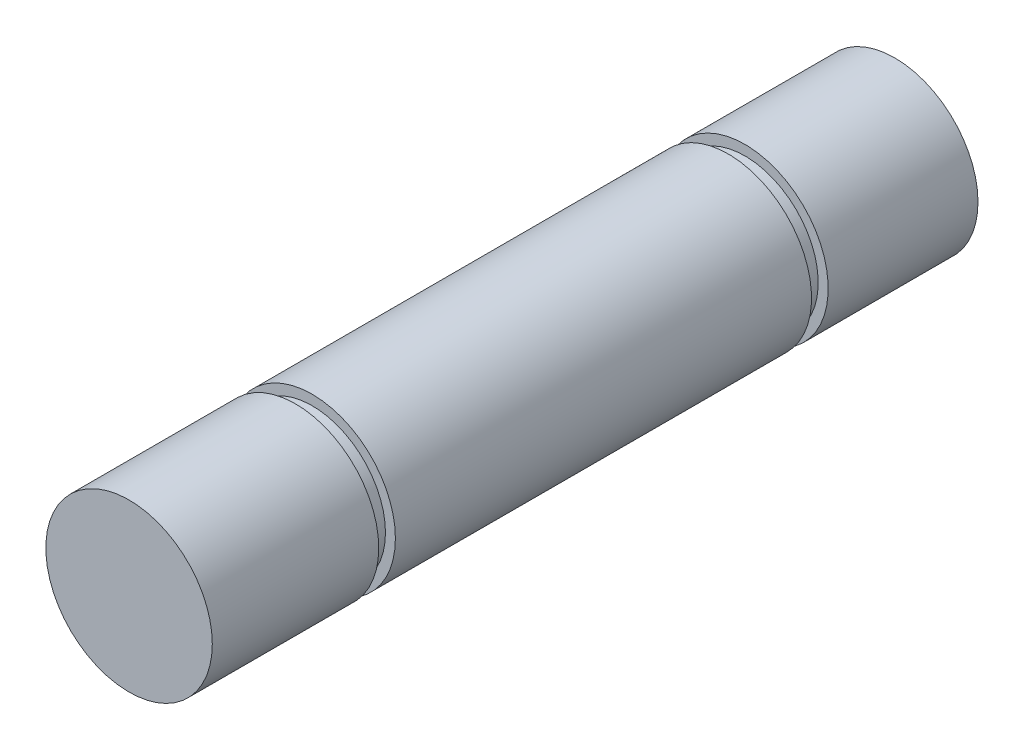
ISO-10303-21;
HEADER;
FILE_DESCRIPTION(('STEP AP214'),'2;1');
FILE_NAME('part.step','',(''),(''),'','','');
FILE_SCHEMA(('AUTOMOTIVE_DESIGN { 1 0 10303 214 1 1 1 1 }'));
ENDSEC;
DATA;
#1=APPLICATION_CONTEXT('core data for automotive mechanical design processes');
#2=APPLICATION_PROTOCOL_DEFINITION('international standard','automotive_design',2000,#1);
#3=PRODUCT_CONTEXT('',#1,'mechanical');
#4=PRODUCT('Part','Part','',(#3));
#5=PRODUCT_RELATED_PRODUCT_CATEGORY('part','',(#4));
#6=PRODUCT_DEFINITION_FORMATION('','',#4);
#7=PRODUCT_DEFINITION_CONTEXT('part definition',#1,'design');
#8=PRODUCT_DEFINITION('design','',#6,#7);
#9=PRODUCT_DEFINITION_SHAPE('','',#8);
#10=(LENGTH_UNIT() NAMED_UNIT(*) SI_UNIT(.MILLI.,.METRE.));
#11=(NAMED_UNIT(*) PLANE_ANGLE_UNIT() SI_UNIT($,.RADIAN.));
#12=(NAMED_UNIT(*) SI_UNIT($,.STERADIAN.) SOLID_ANGLE_UNIT());
#13=UNCERTAINTY_MEASURE_WITH_UNIT(LENGTH_MEASURE(1.E-05),#10,'distance_accuracy_value','');
#14=(GEOMETRIC_REPRESENTATION_CONTEXT(3) GLOBAL_UNCERTAINTY_ASSIGNED_CONTEXT((#13)) GLOBAL_UNIT_ASSIGNED_CONTEXT((#10,
#11,#12)) REPRESENTATION_CONTEXT('',''));
#15=CARTESIAN_POINT('',(0.,0.,0.));
#16=DIRECTION('',(0.,0.,1.));
#17=DIRECTION('',(1.,0.,0.));
#18=AXIS2_PLACEMENT_3D('',#15,#16,#17);
#19=CARTESIAN_POINT('',(0.,0.,23.));
#20=DIRECTION('',(0.,0.,-1.));
#21=DIRECTION('',(-1.,0.,0.));
#22=AXIS2_PLACEMENT_3D('',#19,#20,#21);
#23=CYLINDRICAL_SURFACE('',#22,2.5);
#24=CARTESIAN_POINT('',(0.,0.,17.5));
#25=DIRECTION('',(0.,0.,1.));
#26=DIRECTION('',(1.,0.,0.));
#27=AXIS2_PLACEMENT_3D('',#24,#25,#26);
#28=CIRCLE('',#27,2.5);
#29=CARTESIAN_POINT('',(2.5,0.,17.5));
#30=VERTEX_POINT('',#29);
#31=EDGE_CURVE('E42',#30,#30,#28,.T.);
#32=ORIENTED_EDGE('',*,*,#31,.F.);
#33=EDGE_LOOP('',(#32));
#34=FACE_BOUND('',#33,.T.);
#35=CARTESIAN_POINT('',(0.,0.,5.));
#36=DIRECTION('',(0.,0.,-1.));
#37=DIRECTION('',(-1.,0.,0.));
#38=AXIS2_PLACEMENT_3D('',#35,#36,#37);
#39=CIRCLE('',#38,2.5);
#40=CARTESIAN_POINT('',(-2.5,0.,5.));
#41=VERTEX_POINT('',#40);
#42=EDGE_CURVE('E56',#41,#41,#39,.T.);
#43=ORIENTED_EDGE('',*,*,#42,.F.);
#44=EDGE_LOOP('',(#43));
#45=FACE_BOUND('',#44,.T.);
#46=ADVANCED_FACE('F31',(#34,#45),#23,.T.);
#47=CARTESIAN_POINT('',(0.,0.,17.5));
#48=DIRECTION('',(0.,0.,1.));
#49=DIRECTION('',(1.,0.,0.));
#50=AXIS2_PLACEMENT_3D('',#47,#48,#49);
#51=PLANE('',#50);
#52=CARTESIAN_POINT('',(0.,0.,17.5));
#53=DIRECTION('',(0.,0.,1.));
#54=DIRECTION('',(1.,0.,0.));
#55=AXIS2_PLACEMENT_3D('',#52,#53,#54);
#56=CIRCLE('',#55,2.20136738625725);
#57=CARTESIAN_POINT('',(2.20136738625725,0.,17.5));
#58=VERTEX_POINT('',#57);
#59=EDGE_CURVE('E47',#58,#58,#56,.T.);
#60=ORIENTED_EDGE('',*,*,#59,.F.);
#61=EDGE_LOOP('',(#60));
#62=FACE_BOUND('',#61,.T.);
#63=ORIENTED_EDGE('',*,*,#31,.T.);
#64=EDGE_LOOP('',(#63));
#65=FACE_BOUND('',#64,.T.);
#66=ADVANCED_FACE('F88',(#62,#65),#51,.T.);
#67=CARTESIAN_POINT('',(0.,0.,18.));
#68=DIRECTION('',(0.,0.,1.));
#69=DIRECTION('',(1.,0.,0.));
#70=AXIS2_PLACEMENT_3D('',#67,#68,#69);
#71=PLANE('',#70);
#72=CARTESIAN_POINT('',(0.,0.,18.));
#73=DIRECTION('',(0.,0.,1.));
#74=DIRECTION('',(1.,0.,0.));
#75=AXIS2_PLACEMENT_3D('',#72,#73,#74);
#76=CIRCLE('',#75,2.20136738625725);
#77=CARTESIAN_POINT('',(2.20136738625725,0.,18.));
#78=VERTEX_POINT('',#77);
#79=EDGE_CURVE('E50',#78,#78,#76,.T.);
#80=ORIENTED_EDGE('',*,*,#79,.T.);
#81=EDGE_LOOP('',(#80));
#82=FACE_BOUND('',#81,.T.);
#83=CARTESIAN_POINT('',(0.,0.,18.));
#84=DIRECTION('',(0.,0.,1.));
#85=DIRECTION('',(1.,0.,0.));
#86=AXIS2_PLACEMENT_3D('',#83,#84,#85);
#87=CIRCLE('',#86,2.5);
#88=CARTESIAN_POINT('',(2.5,0.,18.));
#89=VERTEX_POINT('',#88);
#90=EDGE_CURVE('E44',#89,#89,#87,.T.);
#91=ORIENTED_EDGE('',*,*,#90,.F.);
#92=EDGE_LOOP('',(#91));
#93=FACE_BOUND('',#92,.T.);
#94=ADVANCED_FACE('F96',(#82,#93),#71,.F.);
#95=CARTESIAN_POINT('',(0.,0.,17.5));
#96=DIRECTION('',(0.,0.,1.));
#97=DIRECTION('',(1.,0.,0.));
#98=AXIS2_PLACEMENT_3D('',#95,#96,#97);
#99=CYLINDRICAL_SURFACE('',#98,2.20136738625725);
#100=ORIENTED_EDGE('',*,*,#59,.T.);
#101=EDGE_LOOP('',(#100));
#102=FACE_BOUND('',#101,.T.);
#103=ORIENTED_EDGE('',*,*,#79,.F.);
#104=EDGE_LOOP('',(#103));
#105=FACE_BOUND('',#104,.T.);
#106=ADVANCED_FACE('F109',(#102,#105),#99,.T.);
#107=CARTESIAN_POINT('',(0.,0.,23.));
#108=DIRECTION('',(0.,0.,1.));
#109=DIRECTION('',(1.,0.,0.));
#110=AXIS2_PLACEMENT_3D('',#107,#108,#109);
#111=PLANE('',#110);
#112=CARTESIAN_POINT('',(0.,0.,23.));
#113=DIRECTION('',(0.,0.,1.));
#114=DIRECTION('',(1.,0.,0.));
#115=AXIS2_PLACEMENT_3D('',#112,#113,#114);
#116=CIRCLE('',#115,2.5);
#117=CARTESIAN_POINT('',(2.5,0.,23.));
#118=VERTEX_POINT('',#117);
#119=EDGE_CURVE('E10',#118,#118,#116,.T.);
#120=ORIENTED_EDGE('',*,*,#119,.T.);
#121=EDGE_LOOP('',(#120));
#122=FACE_BOUND('',#121,.T.);
#123=ADVANCED_FACE('F103',(#122),#111,.T.);
#124=ORIENTED_EDGE('',*,*,#90,.T.);
#125=EDGE_LOOP('',(#124));
#126=FACE_BOUND('',#125,.T.);
#127=ORIENTED_EDGE('',*,*,#119,.F.);
#128=EDGE_LOOP('',(#127));
#129=FACE_BOUND('',#128,.T.);
#130=ADVANCED_FACE('F33',(#126,#129),#23,.T.);
#131=CARTESIAN_POINT('',(0.,0.,4.5));
#132=DIRECTION('',(0.,0.,-1.));
#133=DIRECTION('',(-1.,0.,0.));
#134=AXIS2_PLACEMENT_3D('',#131,#132,#133);
#135=PLANE('',#134);
#136=CARTESIAN_POINT('',(0.,0.,4.5));
#137=DIRECTION('',(0.,0.,-1.));
#138=DIRECTION('',(-1.,0.,0.));
#139=AXIS2_PLACEMENT_3D('',#136,#137,#138);
#140=CIRCLE('',#139,2.5);
#141=CARTESIAN_POINT('',(-2.5,0.,4.5));
#142=VERTEX_POINT('',#141);
#143=EDGE_CURVE('E53',#142,#142,#140,.T.);
#144=ORIENTED_EDGE('',*,*,#143,.F.);
#145=EDGE_LOOP('',(#144));
#146=FACE_BOUND('',#145,.T.);
#147=CARTESIAN_POINT('',(0.,0.,4.5));
#148=DIRECTION('',(0.,0.,-1.));
#149=DIRECTION('',(-1.,0.,0.));
#150=AXIS2_PLACEMENT_3D('',#147,#148,#149);
#151=CIRCLE('',#150,2.2);
#152=CARTESIAN_POINT('',(-2.2,0.,4.5));
#153=VERTEX_POINT('',#152);
#154=EDGE_CURVE('E59',#153,#153,#151,.T.);
#155=ORIENTED_EDGE('',*,*,#154,.T.);
#156=EDGE_LOOP('',(#155));
#157=FACE_BOUND('',#156,.T.);
#158=ADVANCED_FACE('F68',(#146,#157),#135,.F.);
#159=CARTESIAN_POINT('',(0.,0.,5.));
#160=DIRECTION('',(0.,0.,-1.));
#161=DIRECTION('',(-1.,0.,0.));
#162=AXIS2_PLACEMENT_3D('',#159,#160,#161);
#163=PLANE('',#162);
#164=ORIENTED_EDGE('',*,*,#42,.T.);
#165=EDGE_LOOP('',(#164));
#166=FACE_BOUND('',#165,.T.);
#167=CARTESIAN_POINT('',(0.,0.,5.));
#168=DIRECTION('',(0.,0.,-1.));
#169=DIRECTION('',(-1.,0.,0.));
#170=AXIS2_PLACEMENT_3D('',#167,#168,#169);
#171=CIRCLE('',#170,2.2);
#172=CARTESIAN_POINT('',(-2.2,0.,5.));
#173=VERTEX_POINT('',#172);
#174=EDGE_CURVE('E62',#173,#173,#171,.T.);
#175=ORIENTED_EDGE('',*,*,#174,.F.);
#176=EDGE_LOOP('',(#175));
#177=FACE_BOUND('',#176,.T.);
#178=ADVANCED_FACE('F74',(#166,#177),#163,.T.);
#179=CARTESIAN_POINT('',(0.,0.,4.5));
#180=DIRECTION('',(0.,0.,1.));
#181=DIRECTION('',(1.,0.,0.));
#182=AXIS2_PLACEMENT_3D('',#179,#180,#181);
#183=CYLINDRICAL_SURFACE('',#182,2.2);
#184=ORIENTED_EDGE('',*,*,#154,.F.);
#185=EDGE_LOOP('',(#184));
#186=FACE_BOUND('',#185,.T.);
#187=ORIENTED_EDGE('',*,*,#174,.T.);
#188=EDGE_LOOP('',(#187));
#189=FACE_BOUND('',#188,.T.);
#190=ADVANCED_FACE('F70',(#186,#189),#183,.T.);
#191=CARTESIAN_POINT('',(0.,0.,0.));
#192=DIRECTION('',(0.,0.,1.));
#193=DIRECTION('',(1.,0.,0.));
#194=AXIS2_PLACEMENT_3D('',#191,#192,#193);
#195=PLANE('',#194);
#196=CARTESIAN_POINT('',(0.,0.,0.));
#197=DIRECTION('',(0.,0.,1.));
#198=DIRECTION('',(1.,0.,0.));
#199=AXIS2_PLACEMENT_3D('',#196,#197,#198);
#200=CIRCLE('',#199,2.5);
#201=CARTESIAN_POINT('',(2.5,0.,0.));
#202=VERTEX_POINT('',#201);
#203=EDGE_CURVE('E35',#202,#202,#200,.T.);
#204=ORIENTED_EDGE('',*,*,#203,.F.);
#205=EDGE_LOOP('',(#204));
#206=FACE_BOUND('',#205,.T.);
#207=ADVANCED_FACE('F73',(#206),#195,.F.);
#208=ORIENTED_EDGE('',*,*,#143,.T.);
#209=EDGE_LOOP('',(#208));
#210=FACE_BOUND('',#209,.T.);
#211=ORIENTED_EDGE('',*,*,#203,.T.);
#212=EDGE_LOOP('',(#211));
#213=FACE_BOUND('',#212,.T.);
#214=ADVANCED_FACE('F90',(#210,#213),#23,.T.);
#215=CLOSED_SHELL('',(#46,#66,#94,#106,#123,#130,#158,#178,#190,#207,#214));
#216=MANIFOLD_SOLID_BREP('B2',#215);
#217=ADVANCED_BREP_SHAPE_REPRESENTATION('',(#18,#216),#14);
#218=SHAPE_DEFINITION_REPRESENTATION(#9,#217);
ENDSEC;
END-ISO-10303-21;
